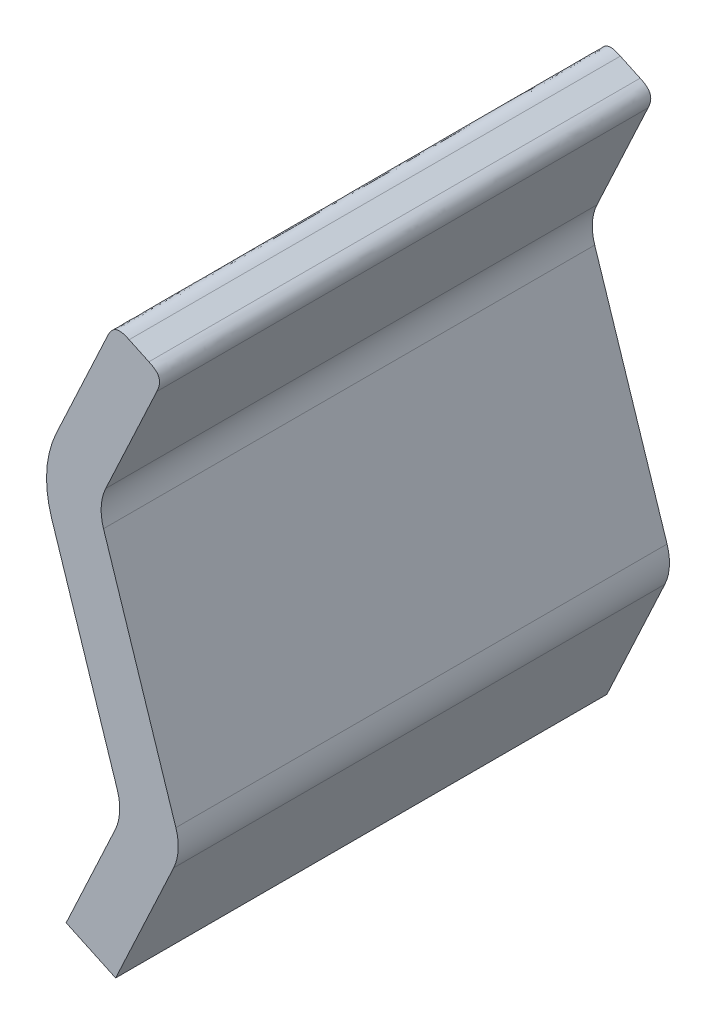
ISO-10303-21;
HEADER;
FILE_DESCRIPTION(('STEP AP214'),'2;1');
FILE_NAME('part.step','',(''),(''),'','','');
FILE_SCHEMA(('AUTOMOTIVE_DESIGN { 1 0 10303 214 1 1 1 1 }'));
ENDSEC;
DATA;
#1=APPLICATION_CONTEXT('core data for automotive mechanical design processes');
#2=APPLICATION_PROTOCOL_DEFINITION('international standard','automotive_design',2000,#1);
#3=PRODUCT_CONTEXT('',#1,'mechanical');
#4=PRODUCT('Part','Part','',(#3));
#5=PRODUCT_RELATED_PRODUCT_CATEGORY('part','',(#4));
#6=PRODUCT_DEFINITION_FORMATION('','',#4);
#7=PRODUCT_DEFINITION_CONTEXT('part definition',#1,'design');
#8=PRODUCT_DEFINITION('design','',#6,#7);
#9=PRODUCT_DEFINITION_SHAPE('','',#8);
#10=(LENGTH_UNIT() NAMED_UNIT(*) SI_UNIT(.MILLI.,.METRE.));
#11=(NAMED_UNIT(*) PLANE_ANGLE_UNIT() SI_UNIT($,.RADIAN.));
#12=(NAMED_UNIT(*) SI_UNIT($,.STERADIAN.) SOLID_ANGLE_UNIT());
#13=UNCERTAINTY_MEASURE_WITH_UNIT(LENGTH_MEASURE(1.E-05),#10,'distance_accuracy_value','');
#14=(GEOMETRIC_REPRESENTATION_CONTEXT(3) GLOBAL_UNCERTAINTY_ASSIGNED_CONTEXT((#13)) GLOBAL_UNIT_ASSIGNED_CONTEXT((#10,
#11,#12)) REPRESENTATION_CONTEXT('',''));
#15=CARTESIAN_POINT('',(0.,0.,0.));
#16=DIRECTION('',(0.,0.,1.));
#17=DIRECTION('',(1.,0.,0.));
#18=AXIS2_PLACEMENT_3D('',#15,#16,#17);
#19=CARTESIAN_POINT('',(-14.1978400032217,-113.814061524335,450.));
#20=DIRECTION('',(0.906239988269344,-0.422763626228155,0.));
#21=DIRECTION('',(0.422763626228155,0.906239988269344,0.));
#22=AXIS2_PLACEMENT_3D('',#19,#20,#21);
#23=PLANE('',#22);
#24=DIRECTION('',(-0.422763626228155,-0.906239988269344,0.));
#25=VECTOR('',#24,1.);
#26=CARTESIAN_POINT('',(-14.1978400032217,-113.814061524335,450.));
#27=LINE('',#26,#25);
#28=CARTESIAN_POINT('',(-22.5243910572331,-131.662932764358,450.));
#29=VERTEX_POINT('',#28);
#30=CARTESIAN_POINT('',(-67.3493273096764,-227.750077408314,450.));
#31=VERTEX_POINT('',#30);
#32=EDGE_CURVE('E150',#29,#31,#27,.T.);
#33=ORIENTED_EDGE('',*,*,#32,.F.);
#34=DIRECTION('',(0.,0.,-1.));
#35=VECTOR('',#34,1.);
#36=CARTESIAN_POINT('',(-22.5243910572331,-131.662932764358,0.));
#37=LINE('',#36,#35);
#38=CARTESIAN_POINT('',(-22.5243910572331,-131.662932764358,0.));
#39=VERTEX_POINT('',#38);
#40=EDGE_CURVE('E172',#29,#39,#37,.T.);
#41=ORIENTED_EDGE('',*,*,#40,.T.);
#42=DIRECTION('',(-0.422763626228155,-0.906239988269344,0.));
#43=VECTOR('',#42,1.);
#44=CARTESIAN_POINT('',(-14.1978400032217,-113.814061524335,0.));
#45=LINE('',#44,#43);
#46=CARTESIAN_POINT('',(-67.3493273096764,-227.750077408314,0.));
#47=VERTEX_POINT('',#46);
#48=EDGE_CURVE('E168',#39,#47,#45,.T.);
#49=ORIENTED_EDGE('',*,*,#48,.T.);
#50=DIRECTION('',(0.,0.,-1.));
#51=VECTOR('',#50,1.);
#52=CARTESIAN_POINT('',(-67.3493273096764,-227.750077408314,450.));
#53=LINE('',#52,#51);
#54=EDGE_CURVE('E166',#31,#47,#53,.T.);
#55=ORIENTED_EDGE('',*,*,#54,.F.);
#56=EDGE_LOOP('',(#33,#41,#49,#55));
#57=FACE_BOUND('',#56,.T.);
#58=ADVANCED_FACE('F40',(#57),#23,.F.);
#59=CARTESIAN_POINT('',(-22.0373278962092,-248.888258719722,450.));
#60=DIRECTION('',(-0.422763626228154,-0.906239988269344,0.));
#61=DIRECTION('',(0.906239988269344,-0.422763626228154,0.));
#62=AXIS2_PLACEMENT_3D('',#59,#60,#61);
#63=PLANE('',#62);
#64=DIRECTION('',(-0.906239988269344,0.422763626228154,0.));
#65=VECTOR('',#64,1.);
#66=CARTESIAN_POINT('',(-22.0373278962092,-248.888258719722,0.));
#67=LINE('',#66,#65);
#68=CARTESIAN_POINT('',(-22.0373278962092,-248.888258719722,0.));
#69=VERTEX_POINT('',#68);
#70=EDGE_CURVE('E413',#69,#47,#67,.T.);
#71=ORIENTED_EDGE('',*,*,#70,.F.);
#72=DIRECTION('',(0.,0.,-1.));
#73=VECTOR('',#72,1.);
#74=CARTESIAN_POINT('',(-22.0373278962092,-248.888258719722,450.));
#75=LINE('',#74,#73);
#76=CARTESIAN_POINT('',(-22.0373278962092,-248.888258719722,450.));
#77=VERTEX_POINT('',#76);
#78=EDGE_CURVE('E173',#77,#69,#75,.T.);
#79=ORIENTED_EDGE('',*,*,#78,.F.);
#80=DIRECTION('',(-0.906239988269344,0.422763626228154,0.));
#81=VECTOR('',#80,1.);
#82=CARTESIAN_POINT('',(-22.0373278962092,-248.888258719722,450.));
#83=LINE('',#82,#81);
#84=EDGE_CURVE('E155',#77,#31,#83,.T.);
#85=ORIENTED_EDGE('',*,*,#84,.T.);
#86=ORIENTED_EDGE('',*,*,#54,.T.);
#87=EDGE_LOOP('',(#71,#79,#85,#86));
#88=FACE_BOUND('',#87,.T.);
#89=ADVANCED_FACE('F175',(#88),#63,.T.);
#90=CARTESIAN_POINT('',(31.1141594102456,-134.952242835743,450.));
#91=DIRECTION('',(0.906239988269344,-0.422763626228155,0.));
#92=DIRECTION('',(0.422763626228155,0.906239988269344,0.));
#93=AXIS2_PLACEMENT_3D('',#90,#91,#92);
#94=PLANE('',#93);
#95=DIRECTION('',(-0.422763626228155,-0.906239988269344,0.));
#96=VECTOR('',#95,1.);
#97=CARTESIAN_POINT('',(31.1141594102456,-134.952242835743,0.));
#98=LINE('',#97,#96);
#99=CARTESIAN_POINT('',(31.1141594102456,-134.952242835743,0.));
#100=VERTEX_POINT('',#99);
#101=EDGE_CURVE('E415',#100,#69,#98,.T.);
#102=ORIENTED_EDGE('',*,*,#101,.F.);
#103=DIRECTION('',(0.,0.,-1.));
#104=VECTOR('',#103,1.);
#105=CARTESIAN_POINT('',(31.1141594102456,-134.952242835743,450.));
#106=LINE('',#105,#104);
#107=CARTESIAN_POINT('',(31.1141594102456,-134.952242835743,450.));
#108=VERTEX_POINT('',#107);
#109=EDGE_CURVE('E436',#108,#100,#106,.T.);
#110=ORIENTED_EDGE('',*,*,#109,.F.);
#111=DIRECTION('',(-0.422763626228155,-0.906239988269344,0.));
#112=VECTOR('',#111,1.);
#113=CARTESIAN_POINT('',(31.1141594102456,-134.952242835743,450.));
#114=LINE('',#113,#112);
#115=EDGE_CURVE('E176',#108,#77,#114,.T.);
#116=ORIENTED_EDGE('',*,*,#115,.T.);
#117=ORIENTED_EDGE('',*,*,#78,.T.);
#118=EDGE_LOOP('',(#102,#110,#116,#117));
#119=FACE_BOUND('',#118,.T.);
#120=ADVANCED_FACE('F231',(#119),#94,.T.);
#121=CARTESIAN_POINT('',(-9.66664006187486,-115.927879655475,450.));
#122=DIRECTION('',(0.,0.,-1.));
#123=DIRECTION('',(-1.,0.,0.));
#124=AXIS2_PLACEMENT_3D('',#121,#122,#123);
#125=CYLINDRICAL_SURFACE('',#124,45.);
#126=CARTESIAN_POINT('',(-9.66664006187486,-115.927879655475,0.));
#127=DIRECTION('',(0.,0.,-1.));
#128=DIRECTION('',(-1.,0.,0.));
#129=AXIS2_PLACEMENT_3D('',#126,#127,#128);
#130=CIRCLE('',#129,45.);
#131=CARTESIAN_POINT('',(33.1331330772249,-102.028979726287,0.));
#132=VERTEX_POINT('',#131);
#133=EDGE_CURVE('E418',#132,#100,#130,.T.);
#134=ORIENTED_EDGE('',*,*,#133,.F.);
#135=DIRECTION('',(0.,0.,-1.));
#136=VECTOR('',#135,1.);
#137=CARTESIAN_POINT('',(33.1331330772249,-102.028979726287,450.));
#138=LINE('',#137,#136);
#139=CARTESIAN_POINT('',(33.1331330772249,-102.028979726287,450.));
#140=VERTEX_POINT('',#139);
#141=EDGE_CURVE('E432',#140,#132,#138,.T.);
#142=ORIENTED_EDGE('',*,*,#141,.F.);
#143=CARTESIAN_POINT('',(-9.66664006187486,-115.927879655475,450.));
#144=DIRECTION('',(0.,0.,-1.));
#145=DIRECTION('',(-1.,0.,0.));
#146=AXIS2_PLACEMENT_3D('',#143,#144,#145);
#147=CIRCLE('',#146,45.);
#148=EDGE_CURVE('E178',#140,#108,#147,.T.);
#149=ORIENTED_EDGE('',*,*,#148,.T.);
#150=ORIENTED_EDGE('',*,*,#109,.T.);
#151=EDGE_LOOP('',(#134,#142,#149,#150));
#152=FACE_BOUND('',#151,.T.);
#153=ADVANCED_FACE('F227',(#152),#125,.T.);
#154=CARTESIAN_POINT('',(-33.1331330772249,102.028979726287,450.));
#155=DIRECTION('',(0.951106069757775,0.308864442870848,0.));
#156=DIRECTION('',(-0.308864442870848,0.951106069757775,0.));
#157=AXIS2_PLACEMENT_3D('',#154,#155,#156);
#158=PLANE('',#157);
#159=DIRECTION('',(0.308864442870848,-0.951106069757775,0.));
#160=VECTOR('',#159,1.);
#161=CARTESIAN_POINT('',(-33.1331330772249,102.028979726287,0.));
#162=LINE('',#161,#160);
#163=CARTESIAN_POINT('',(-33.1331330772249,102.028979726287,0.));
#164=VERTEX_POINT('',#163);
#165=EDGE_CURVE('E421',#164,#132,#162,.T.);
#166=ORIENTED_EDGE('',*,*,#165,.F.);
#167=DIRECTION('',(0.,0.,-1.));
#168=VECTOR('',#167,1.);
#169=CARTESIAN_POINT('',(-33.1331330772249,102.028979726287,450.));
#170=LINE('',#169,#168);
#171=CARTESIAN_POINT('',(-33.1331330772249,102.028979726287,450.));
#172=VERTEX_POINT('',#171);
#173=EDGE_CURVE('E430',#172,#164,#170,.T.);
#174=ORIENTED_EDGE('',*,*,#173,.F.);
#175=DIRECTION('',(0.308864442870848,-0.951106069757775,0.));
#176=VECTOR('',#175,1.);
#177=CARTESIAN_POINT('',(-33.1331330772249,102.028979726287,450.));
#178=LINE('',#177,#176);
#179=EDGE_CURVE('E183',#172,#140,#178,.T.);
#180=ORIENTED_EDGE('',*,*,#179,.T.);
#181=ORIENTED_EDGE('',*,*,#141,.T.);
#182=EDGE_LOOP('',(#166,#174,#180,#181));
#183=FACE_BOUND('',#182,.T.);
#184=ADVANCED_FACE('F223',(#183),#158,.T.);
#185=CARTESIAN_POINT('',(9.6666400618749,115.927879655475,450.));
#186=DIRECTION('',(0.,0.,-1.));
#187=DIRECTION('',(-1.,0.,0.));
#188=AXIS2_PLACEMENT_3D('',#185,#186,#187);
#189=CYLINDRICAL_SURFACE('',#188,45.);
#190=CARTESIAN_POINT('',(9.6666400618749,115.927879655475,0.));
#191=DIRECTION('',(0.,0.,1.));
#192=DIRECTION('',(1.,0.,0.));
#193=AXIS2_PLACEMENT_3D('',#190,#191,#192);
#194=CIRCLE('',#193,45.);
#195=CARTESIAN_POINT('',(-31.1141594102455,134.952242835743,0.));
#196=VERTEX_POINT('',#195);
#197=EDGE_CURVE('E354',#196,#164,#194,.T.);
#198=ORIENTED_EDGE('',*,*,#197,.F.);
#199=DIRECTION('',(0.,0.,-1.));
#200=VECTOR('',#199,1.);
#201=CARTESIAN_POINT('',(-31.1141594102455,134.952242835743,450.));
#202=LINE('',#201,#200);
#203=CARTESIAN_POINT('',(-31.1141594102455,134.952242835743,450.));
#204=VERTEX_POINT('',#203);
#205=EDGE_CURVE('E428',#204,#196,#202,.T.);
#206=ORIENTED_EDGE('',*,*,#205,.F.);
#207=CARTESIAN_POINT('',(9.6666400618749,115.927879655475,450.));
#208=DIRECTION('',(0.,0.,1.));
#209=DIRECTION('',(1.,0.,0.));
#210=AXIS2_PLACEMENT_3D('',#207,#208,#209);
#211=CIRCLE('',#210,45.);
#212=EDGE_CURVE('E186',#204,#172,#211,.T.);
#213=ORIENTED_EDGE('',*,*,#212,.T.);
#214=ORIENTED_EDGE('',*,*,#173,.T.);
#215=EDGE_LOOP('',(#198,#206,#213,#214));
#216=FACE_BOUND('',#215,.T.);
#217=ADVANCED_FACE('F218',(#216),#189,.F.);
#218=CARTESIAN_POINT('',(22.0373278962092,248.888258719722,450.));
#219=DIRECTION('',(0.906239988269344,-0.422763626228155,0.));
#220=DIRECTION('',(0.422763626228155,0.906239988269344,0.));
#221=AXIS2_PLACEMENT_3D('',#218,#219,#220);
#222=PLANE('',#221);
#223=DIRECTION('',(-0.422763626228155,-0.906239988269344,0.));
#224=VECTOR('',#223,1.);
#225=CARTESIAN_POINT('',(22.0373278962092,248.888258719722,0.));
#226=LINE('',#225,#224);
#227=CARTESIAN_POINT('',(15.6958735027869,235.294658895682,0.));
#228=VERTEX_POINT('',#227);
#229=EDGE_CURVE('E337',#228,#196,#226,.T.);
#230=ORIENTED_EDGE('',*,*,#229,.F.);
#231=CARTESIAN_POINT('',(15.6958735027869,235.294658895682,472.5));
#232=CARTESIAN_POINT('',(15.6958735027869,235.294658895682,307.499999990841));
#233=CARTESIAN_POINT('',(15.6958735027869,235.294658895682,142.5));
#234=CARTESIAN_POINT('',(15.6958735027869,235.294658895682,-22.5000000000001));
#235=B_SPLINE_CURVE_WITH_KNOTS('',3,(#231,#232,#233,#234),.UNSPECIFIED.,.F.,.F.,(4,4),(-0.0225,
0.4725),.UNSPECIFIED.);
#236=CARTESIAN_POINT('',(15.6958735027869,235.294658895682,450.));
#237=VERTEX_POINT('',#236);
#238=EDGE_CURVE('E70',#228,#237,#235,.F.);
#239=ORIENTED_EDGE('',*,*,#238,.T.);
#240=DIRECTION('',(-0.422763626228155,-0.906239988269344,0.));
#241=VECTOR('',#240,1.);
#242=CARTESIAN_POINT('',(22.0373278962092,248.888258719722,450.));
#243=LINE('',#242,#241);
#244=EDGE_CURVE('E189',#237,#204,#243,.T.);
#245=ORIENTED_EDGE('',*,*,#244,.T.);
#246=ORIENTED_EDGE('',*,*,#205,.T.);
#247=EDGE_LOOP('',(#230,#239,#245,#246));
#248=FACE_BOUND('',#247,.T.);
#249=ADVANCED_FACE('F207',(#248),#222,.T.);
#250=CARTESIAN_POINT('',(-23.274671517258,270.02644003113,450.));
#251=DIRECTION('',(0.422763626228155,0.906239988269344,0.));
#252=DIRECTION('',(-0.906239988269344,0.422763626228155,0.));
#253=AXIS2_PLACEMENT_3D('',#250,#251,#252);
#254=PLANE('',#253);
#255=DIRECTION('',(0.906239988269344,-0.422763626228155,0.));
#256=VECTOR('',#255,1.);
#257=CARTESIAN_POINT('',(-23.274671517258,270.02644003113,450.));
#258=LINE('',#257,#256);
#259=CARTESIAN_POINT('',(-9.68107169321786,263.684985637707,450.));
#260=VERTEX_POINT('',#259);
#261=CARTESIAN_POINT('',(8.44372807216904,255.229713113144,450.));
#262=VERTEX_POINT('',#261);
#263=EDGE_CURVE('E196',#260,#262,#258,.T.);
#264=ORIENTED_EDGE('',*,*,#263,.T.);
#265=CARTESIAN_POINT('',(8.44372807216903,255.229713113144,-22.5000000000001));
#266=CARTESIAN_POINT('',(8.44372807216903,255.229713113144,142.5));
#267=CARTESIAN_POINT('',(8.44372807216903,255.229713113144,307.499999990841));
#268=CARTESIAN_POINT('',(8.44372807216903,255.229713113144,472.5));
#269=B_SPLINE_CURVE_WITH_KNOTS('',3,(#265,#266,#267,#268),.UNSPECIFIED.,.F.,.F.,(4,4),(-0.0225,
0.4725),.UNSPECIFIED.);
#270=CARTESIAN_POINT('',(8.44372807216904,255.229713113144,0.));
#271=VERTEX_POINT('',#270);
#272=EDGE_CURVE('E324',#262,#271,#269,.F.);
#273=ORIENTED_EDGE('',*,*,#272,.T.);
#274=DIRECTION('',(0.906239988269344,-0.422763626228155,0.));
#275=VECTOR('',#274,1.);
#276=CARTESIAN_POINT('',(-23.274671517258,270.02644003113,0.));
#277=LINE('',#276,#275);
#278=CARTESIAN_POINT('',(-9.68107169321778,263.684985637707,0.));
#279=VERTEX_POINT('',#278);
#280=EDGE_CURVE('E332',#279,#271,#277,.T.);
#281=ORIENTED_EDGE('',*,*,#280,.F.);
#282=CARTESIAN_POINT('',(-9.68107169321787,263.684985637707,472.5));
#283=CARTESIAN_POINT('',(-9.68107169321787,263.684985637707,307.499999990841));
#284=CARTESIAN_POINT('',(-9.68107169321787,263.684985637707,142.5));
#285=CARTESIAN_POINT('',(-9.68107169321787,263.684985637707,-22.5));
#286=B_SPLINE_CURVE_WITH_KNOTS('',3,(#282,#283,#284,#285),.UNSPECIFIED.,.F.,.F.,(4,4),(-0.4725,
0.0225),.UNSPECIFIED.);
#287=EDGE_CURVE('E319',#279,#260,#286,.F.);
#288=ORIENTED_EDGE('',*,*,#287,.T.);
#289=EDGE_LOOP('',(#264,#273,#281,#288));
#290=FACE_BOUND('',#289,.T.);
#291=ADVANCED_FACE('F217',(#290),#254,.T.);
#292=CARTESIAN_POINT('',(-23.274671517258,270.02644003113,450.));
#293=DIRECTION('',(0.906239988269344,-0.422763626228155,0.));
#294=DIRECTION('',(0.422763626228155,0.906239988269344,0.));
#295=AXIS2_PLACEMENT_3D('',#292,#293,#294);
#296=PLANE('',#295);
#297=DIRECTION('',(-0.422763626228155,-0.906239988269344,0.));
#298=VECTOR('',#297,1.);
#299=CARTESIAN_POINT('',(-23.274671517258,270.02644003113,450.));
#300=LINE('',#299,#298);
#301=CARTESIAN_POINT('',(-29.6161259106804,256.432840207089,450.));
#302=VERTEX_POINT('',#301);
#303=CARTESIAN_POINT('',(-76.4261588237126,156.090424147151,450.));
#304=VERTEX_POINT('',#303);
#305=EDGE_CURVE('E206',#302,#304,#300,.T.);
#306=ORIENTED_EDGE('',*,*,#305,.F.);
#307=CARTESIAN_POINT('',(-29.6161259106804,256.432840207089,-22.5));
#308=CARTESIAN_POINT('',(-29.6161259106804,256.432840207089,142.5));
#309=CARTESIAN_POINT('',(-29.6161259106804,256.432840207089,307.499999990841));
#310=CARTESIAN_POINT('',(-29.6161259106804,256.432840207089,472.5));
#311=B_SPLINE_CURVE_WITH_KNOTS('',3,(#307,#308,#309,#310),.UNSPECIFIED.,.F.,.F.,(4,4),(-0.4725,
0.0225),.UNSPECIFIED.);
#312=CARTESIAN_POINT('',(-29.6161259106804,256.432840207089,0.));
#313=VERTEX_POINT('',#312);
#314=EDGE_CURVE('E11',#302,#313,#311,.F.);
#315=ORIENTED_EDGE('',*,*,#314,.T.);
#316=DIRECTION('',(-0.422763626228155,-0.906239988269344,0.));
#317=VECTOR('',#316,1.);
#318=CARTESIAN_POINT('',(-23.274671517258,270.02644003113,0.));
#319=LINE('',#318,#317);
#320=CARTESIAN_POINT('',(-76.4261588237126,156.090424147151,0.));
#321=VERTEX_POINT('',#320);
#322=EDGE_CURVE('E336',#313,#321,#319,.T.);
#323=ORIENTED_EDGE('',*,*,#322,.T.);
#324=DIRECTION('',(0.,0.,-1.));
#325=VECTOR('',#324,1.);
#326=CARTESIAN_POINT('',(-76.4261588237126,156.090424147151,450.));
#327=LINE('',#326,#325);
#328=EDGE_CURVE('E450',#304,#321,#327,.T.);
#329=ORIENTED_EDGE('',*,*,#328,.F.);
#330=EDGE_LOOP('',(#306,#315,#323,#329));
#331=FACE_BOUND('',#330,.T.);
#332=ADVANCED_FACE('F377',(#331),#296,.F.);
#333=CARTESIAN_POINT('',(9.6666400618749,115.927879655475,450.));
#334=DIRECTION('',(0.,0.,-1.));
#335=DIRECTION('',(-1.,0.,0.));
#336=AXIS2_PLACEMENT_3D('',#333,#334,#335);
#337=CYLINDRICAL_SURFACE('',#336,95.);
#338=CARTESIAN_POINT('',(9.6666400618749,115.927879655475,0.));
#339=DIRECTION('',(0.,0.,1.));
#340=DIRECTION('',(1.,0.,0.));
#341=AXIS2_PLACEMENT_3D('',#338,#339,#340);
#342=CIRCLE('',#341,95.);
#343=CARTESIAN_POINT('',(-80.6884365651136,86.5857575827448,0.));
#344=VERTEX_POINT('',#343);
#345=EDGE_CURVE('E345',#321,#344,#342,.T.);
#346=ORIENTED_EDGE('',*,*,#345,.T.);
#347=DIRECTION('',(0.,0.,-1.));
#348=VECTOR('',#347,1.);
#349=CARTESIAN_POINT('',(-80.6884365651136,86.5857575827448,450.));
#350=LINE('',#349,#348);
#351=CARTESIAN_POINT('',(-80.6884365651136,86.5857575827448,450.));
#352=VERTEX_POINT('',#351);
#353=EDGE_CURVE('E408',#352,#344,#350,.T.);
#354=ORIENTED_EDGE('',*,*,#353,.F.);
#355=CARTESIAN_POINT('',(9.6666400618749,115.927879655475,450.));
#356=DIRECTION('',(0.,0.,1.));
#357=DIRECTION('',(1.,0.,0.));
#358=AXIS2_PLACEMENT_3D('',#355,#356,#357);
#359=CIRCLE('',#358,95.);
#360=EDGE_CURVE('E402',#304,#352,#359,.T.);
#361=ORIENTED_EDGE('',*,*,#360,.F.);
#362=ORIENTED_EDGE('',*,*,#328,.T.);
#363=EDGE_LOOP('',(#346,#354,#361,#362));
#364=FACE_BOUND('',#363,.T.);
#365=ADVANCED_FACE('F374',(#364),#337,.T.);
#366=CARTESIAN_POINT('',(-80.6884365651136,86.5857575827448,450.));
#367=DIRECTION('',(0.951106069757775,0.308864442870848,0.));
#368=DIRECTION('',(-0.308864442870848,0.951106069757775,0.));
#369=AXIS2_PLACEMENT_3D('',#366,#367,#368);
#370=PLANE('',#369);
#371=DIRECTION('',(0.308864442870848,-0.951106069757775,0.));
#372=VECTOR('',#371,1.);
#373=CARTESIAN_POINT('',(-80.6884365651136,86.5857575827448,0.));
#374=LINE('',#373,#372);
#375=CARTESIAN_POINT('',(-20.5054173902537,-98.7396696549025,0.));
#376=VERTEX_POINT('',#375);
#377=EDGE_CURVE('E163',#344,#376,#374,.T.);
#378=ORIENTED_EDGE('',*,*,#377,.T.);
#379=DIRECTION('',(0.,0.,-1.));
#380=VECTOR('',#379,1.);
#381=CARTESIAN_POINT('',(-20.5054173902537,-98.7396696549025,450.));
#382=LINE('',#381,#380);
#383=CARTESIAN_POINT('',(-20.5054173902537,-98.7396696549025,450.));
#384=VERTEX_POINT('',#383);
#385=EDGE_CURVE('E328',#376,#384,#382,.F.);
#386=ORIENTED_EDGE('',*,*,#385,.T.);
#387=DIRECTION('',(0.308864442870848,-0.951106069757775,0.));
#388=VECTOR('',#387,1.);
#389=CARTESIAN_POINT('',(-80.6884365651136,86.5857575827448,450.));
#390=LINE('',#389,#388);
#391=EDGE_CURVE('E404',#352,#384,#390,.T.);
#392=ORIENTED_EDGE('',*,*,#391,.F.);
#393=ORIENTED_EDGE('',*,*,#353,.T.);
#394=EDGE_LOOP('',(#378,#386,#392,#393));
#395=FACE_BOUND('',#394,.T.);
#396=ADVANCED_FACE('F370',(#395),#370,.F.);
#397=CARTESIAN_POINT('',(-9.66664006187486,-115.927879655475,450.));
#398=DIRECTION('',(0.,0.,-1.));
#399=DIRECTION('',(-1.,0.,0.));
#400=AXIS2_PLACEMENT_3D('',#397,#398,#399);
#401=PLANE('',#400);
#402=ORIENTED_EDGE('',*,*,#244,.F.);
#403=CARTESIAN_POINT('',(8.44372807216903,255.229713113144,450.00000000044));
#404=CARTESIAN_POINT('',(10.7301450759048,254.163092840279,450.00000000044));
#405=CARTESIAN_POINT('',(13.0165620796405,253.096472567414,450.00000000044));
#406=CARTESIAN_POINT('',(17.6012236484666,249.771076440101,449.999999999302));
#407=CARTESIAN_POINT('',(19.2054076380921,245.361416552014,449.999999999302));
#408=CARTESIAN_POINT('',(17.8291140485169,239.867492903153,450.00000000044));
#409=CARTESIAN_POINT('',(16.7624937756519,237.581075899417,450.00000000044));
#410=CARTESIAN_POINT('',(15.6958735027869,235.294658895682,450.00000000044));
#411=B_SPLINE_CURVE_WITH_KNOTS('',5,(#403,#404,#405,#406,#407,#408,#409,#410),.UNSPECIFIED.,.F.,
.F.,(6,2,6),(0.,0.5,1.),.UNSPECIFIED.);
#412=EDGE_CURVE('E54',#237,#262,#411,.F.);
#413=ORIENTED_EDGE('',*,*,#412,.T.);
#414=ORIENTED_EDGE('',*,*,#263,.F.);
#415=CARTESIAN_POINT('',(-29.6161259106804,256.432840207089,450.));
#416=CARTESIAN_POINT('',(-28.5495056378153,258.719257210825,450.));
#417=CARTESIAN_POINT('',(-27.4828853649503,261.005674214561,450.));
#418=CARTESIAN_POINT('',(-24.1574892376373,265.590335783387,450.));
#419=CARTESIAN_POINT('',(-19.7478293495503,267.194519773012,450.));
#420=CARTESIAN_POINT('',(-14.2539057006894,265.818226183437,450.));
#421=CARTESIAN_POINT('',(-11.9674886969536,264.751605910572,450.));
#422=CARTESIAN_POINT('',(-9.68107169321787,263.684985637707,450.));
#423=B_SPLINE_CURVE_WITH_KNOTS('',5,(#415,#416,#417,#418,#419,#420,#421,#422),.UNSPECIFIED.,.F.,
.F.,(6,2,6),(0.,0.5,1.),.UNSPECIFIED.);
#424=EDGE_CURVE('E61',#260,#302,#423,.F.);
#425=ORIENTED_EDGE('',*,*,#424,.T.);
#426=ORIENTED_EDGE('',*,*,#305,.T.);
#427=ORIENTED_EDGE('',*,*,#360,.T.);
#428=ORIENTED_EDGE('',*,*,#391,.T.);
#429=CARTESIAN_POINT('',(-63.3051905293536,-112.638569584091,450.));
#430=DIRECTION('',(0.,0.,-1.));
#431=DIRECTION('',(-1.,0.,0.));
#432=AXIS2_PLACEMENT_3D('',#429,#430,#431);
#433=CIRCLE('',#432,45.);
#434=EDGE_CURVE('E159',#384,#29,#433,.T.);
#435=ORIENTED_EDGE('',*,*,#434,.T.);
#436=ORIENTED_EDGE('',*,*,#32,.T.);
#437=ORIENTED_EDGE('',*,*,#84,.F.);
#438=ORIENTED_EDGE('',*,*,#115,.F.);
#439=ORIENTED_EDGE('',*,*,#148,.F.);
#440=ORIENTED_EDGE('',*,*,#179,.F.);
#441=ORIENTED_EDGE('',*,*,#212,.F.);
#442=EDGE_LOOP('',(#402,#413,#414,#425,#426,#427,#428,#435,#436,#437,#438,#439,#440,#441));
#443=FACE_BOUND('',#442,.T.);
#444=ADVANCED_FACE('F152',(#443),#401,.F.);
#445=CARTESIAN_POINT('',(-9.66664006187486,-115.927879655475,0.));
#446=DIRECTION('',(0.,0.,-1.));
#447=DIRECTION('',(-1.,0.,0.));
#448=AXIS2_PLACEMENT_3D('',#445,#446,#447);
#449=PLANE('',#448);
#450=ORIENTED_EDGE('',*,*,#280,.T.);
#451=CARTESIAN_POINT('',(15.6958735027869,235.294658895682,2.08973463533546E-11));
#452=CARTESIAN_POINT('',(16.7624937756519,237.581075899417,2.08973463533546E-11));
#453=CARTESIAN_POINT('',(17.8291140485169,239.867492903153,2.08973463533546E-11));
#454=CARTESIAN_POINT('',(19.2054076380921,245.361416552014,-3.32945476744229E-11));
#455=CARTESIAN_POINT('',(17.6012236484666,249.771076440101,-3.32945476744229E-11));
#456=CARTESIAN_POINT('',(13.0165620796405,253.096472567414,2.08973463533546E-11));
#457=CARTESIAN_POINT('',(10.7301450759048,254.163092840279,2.08973463533546E-11));
#458=CARTESIAN_POINT('',(8.44372807216903,255.229713113144,2.08973463533546E-11));
#459=B_SPLINE_CURVE_WITH_KNOTS('',5,(#451,#452,#453,#454,#455,#456,#457,#458),.UNSPECIFIED.,.F.,
.F.,(6,2,6),(0.,0.5,1.),.UNSPECIFIED.);
#460=EDGE_CURVE('E393',#271,#228,#459,.F.);
#461=ORIENTED_EDGE('',*,*,#460,.T.);
#462=ORIENTED_EDGE('',*,*,#229,.T.);
#463=ORIENTED_EDGE('',*,*,#197,.T.);
#464=ORIENTED_EDGE('',*,*,#165,.T.);
#465=ORIENTED_EDGE('',*,*,#133,.T.);
#466=ORIENTED_EDGE('',*,*,#101,.T.);
#467=ORIENTED_EDGE('',*,*,#70,.T.);
#468=ORIENTED_EDGE('',*,*,#48,.F.);
#469=CARTESIAN_POINT('',(-63.3051905293536,-112.638569584091,0.));
#470=DIRECTION('',(0.,0.,-1.));
#471=DIRECTION('',(-1.,0.,0.));
#472=AXIS2_PLACEMENT_3D('',#469,#470,#471);
#473=CIRCLE('',#472,45.);
#474=EDGE_CURVE('E326',#39,#376,#473,.F.);
#475=ORIENTED_EDGE('',*,*,#474,.T.);
#476=ORIENTED_EDGE('',*,*,#377,.F.);
#477=ORIENTED_EDGE('',*,*,#345,.F.);
#478=ORIENTED_EDGE('',*,*,#322,.F.);
#479=CARTESIAN_POINT('',(-9.68107169321787,263.684985637707,0.));
#480=CARTESIAN_POINT('',(-11.9674886969536,264.751605910572,0.));
#481=CARTESIAN_POINT('',(-14.2539057006894,265.818226183437,0.));
#482=CARTESIAN_POINT('',(-19.7478293495503,267.194519773012,0.));
#483=CARTESIAN_POINT('',(-24.1574892376373,265.590335783387,0.));
#484=CARTESIAN_POINT('',(-27.4828853649503,261.005674214561,0.));
#485=CARTESIAN_POINT('',(-28.5495056378153,258.719257210825,0.));
#486=CARTESIAN_POINT('',(-29.6161259106803,256.432840207089,0.));
#487=B_SPLINE_CURVE_WITH_KNOTS('',5,(#479,#480,#481,#482,#483,#484,#485,#486),.UNSPECIFIED.,.F.,
.F.,(6,2,6),(0.,0.5,1.),.UNSPECIFIED.);
#488=EDGE_CURVE('E293',#313,#279,#487,.F.);
#489=ORIENTED_EDGE('',*,*,#488,.T.);
#490=EDGE_LOOP('',(#450,#461,#462,#463,#464,#465,#466,#467,#468,#475,#476,#477,#478,#489));
#491=FACE_BOUND('',#490,.T.);
#492=ADVANCED_FACE('F243',(#491),#449,.T.);
#493=CARTESIAN_POINT('',(-63.3051905293536,-112.638569584091,450.));
#494=DIRECTION('',(0.,0.,1.));
#495=DIRECTION('',(1.,0.,0.));
#496=AXIS2_PLACEMENT_3D('',#493,#494,#495);
#497=CYLINDRICAL_SURFACE('',#496,45.);
#498=ORIENTED_EDGE('',*,*,#434,.F.);
#499=ORIENTED_EDGE('',*,*,#385,.F.);
#500=ORIENTED_EDGE('',*,*,#474,.F.);
#501=ORIENTED_EDGE('',*,*,#40,.F.);
#502=EDGE_LOOP('',(#498,#499,#500,#501));
#503=FACE_BOUND('',#502,.T.);
#504=ADVANCED_FACE('F240',(#503),#497,.F.);
#505=CARTESIAN_POINT('',(8.44372807216903,255.229713113144,472.5));
#506=CARTESIAN_POINT('',(8.44372807216903,255.229713113144,307.499999990841));
#507=CARTESIAN_POINT('',(8.44372807216903,255.229713113144,142.5));
#508=CARTESIAN_POINT('',(8.44372807216903,255.229713113144,-22.5000000000001));
#509=CARTESIAN_POINT('',(10.7301450759048,254.163092840279,472.5));
#510=CARTESIAN_POINT('',(10.7301450759048,254.163092840279,307.499999990841));
#511=CARTESIAN_POINT('',(10.7301450759048,254.163092840279,142.5));
#512=CARTESIAN_POINT('',(10.7301450759048,254.163092840279,-22.5000000000001));
#513=CARTESIAN_POINT('',(13.0165620796405,253.096472567414,472.5));
#514=CARTESIAN_POINT('',(13.0165620796405,253.096472567414,307.499999990841));
#515=CARTESIAN_POINT('',(13.0165620796405,253.096472567414,142.5));
#516=CARTESIAN_POINT('',(13.0165620796405,253.096472567414,-22.5000000000001));
#517=CARTESIAN_POINT('',(17.6012236484666,249.771076440101,472.5));
#518=CARTESIAN_POINT('',(17.6012236484666,249.771076440101,307.499999981681));
#519=CARTESIAN_POINT('',(17.6012236484666,249.771076440101,142.5));
#520=CARTESIAN_POINT('',(17.6012236484666,249.771076440101,-22.5000000000001));
#521=CARTESIAN_POINT('',(19.2054076380921,245.361416552014,472.5));
#522=CARTESIAN_POINT('',(19.2054076380921,245.361416552014,307.499999981681));
#523=CARTESIAN_POINT('',(19.2054076380921,245.361416552014,142.5));
#524=CARTESIAN_POINT('',(19.2054076380921,245.361416552014,-22.5000000000001));
#525=CARTESIAN_POINT('',(17.8291140485169,239.867492903153,472.5));
#526=CARTESIAN_POINT('',(17.8291140485169,239.867492903153,307.499999990841));
#527=CARTESIAN_POINT('',(17.8291140485169,239.867492903153,142.5));
#528=CARTESIAN_POINT('',(17.8291140485169,239.867492903153,-22.5000000000001));
#529=CARTESIAN_POINT('',(16.7624937756519,237.581075899417,472.5));
#530=CARTESIAN_POINT('',(16.7624937756519,237.581075899417,307.499999990841));
#531=CARTESIAN_POINT('',(16.7624937756519,237.581075899417,142.5));
#532=CARTESIAN_POINT('',(16.7624937756519,237.581075899417,-22.5000000000001));
#533=CARTESIAN_POINT('',(15.6958735027869,235.294658895682,472.5));
#534=CARTESIAN_POINT('',(15.6958735027869,235.294658895682,307.499999990841));
#535=CARTESIAN_POINT('',(15.6958735027869,235.294658895682,142.5));
#536=CARTESIAN_POINT('',(15.6958735027869,235.294658895682,-22.5000000000001));
#537=B_SPLINE_SURFACE_WITH_KNOTS('',5,3,((#505,#506,#507,#508),(#509,#510,#511,#512),(#513,#514,
#515,#516),(#517,#518,#519,#520),(#521,#522,#523,#524),(#525,#526,#527,#528),(#529,#530,#531,
#532),(#533,#534,#535,#536)),.UNSPECIFIED.,.F.,.F.,.F.,(6,2,6),(4,4),(0.,0.5,1.),(-0.0225,
0.4725),.UNSPECIFIED.);
#538=ORIENTED_EDGE('',*,*,#412,.F.);
#539=ORIENTED_EDGE('',*,*,#238,.F.);
#540=ORIENTED_EDGE('',*,*,#460,.F.);
#541=ORIENTED_EDGE('',*,*,#272,.F.);
#542=EDGE_LOOP('',(#538,#539,#540,#541));
#543=FACE_BOUND('',#542,.T.);
#544=ADVANCED_FACE('F242',(#543),#537,.T.);
#545=CARTESIAN_POINT('',(-9.68107169321787,263.684985637707,-22.5));
#546=CARTESIAN_POINT('',(-9.68107169321787,263.684985637707,142.5));
#547=CARTESIAN_POINT('',(-9.68107169321787,263.684985637707,307.499999990841));
#548=CARTESIAN_POINT('',(-9.68107169321787,263.684985637707,472.5));
#549=CARTESIAN_POINT('',(-11.9674886969536,264.751605910572,-22.5));
#550=CARTESIAN_POINT('',(-11.9674886969536,264.751605910572,142.5));
#551=CARTESIAN_POINT('',(-11.9674886969536,264.751605910572,307.499999990841));
#552=CARTESIAN_POINT('',(-11.9674886969536,264.751605910572,472.5));
#553=CARTESIAN_POINT('',(-14.2539057006894,265.818226183437,-22.5));
#554=CARTESIAN_POINT('',(-14.2539057006894,265.818226183437,142.5));
#555=CARTESIAN_POINT('',(-14.2539057006894,265.818226183437,307.499999990841));
#556=CARTESIAN_POINT('',(-14.2539057006894,265.818226183437,472.5));
#557=CARTESIAN_POINT('',(-19.7478293495503,267.194519773012,-22.5));
#558=CARTESIAN_POINT('',(-19.7478293495503,267.194519773012,142.5));
#559=CARTESIAN_POINT('',(-19.7478293495503,267.194519773012,307.499999990841));
#560=CARTESIAN_POINT('',(-19.7478293495503,267.194519773012,472.5));
#561=CARTESIAN_POINT('',(-24.1574892376373,265.590335783387,-22.5));
#562=CARTESIAN_POINT('',(-24.1574892376373,265.590335783387,142.5));
#563=CARTESIAN_POINT('',(-24.1574892376373,265.590335783387,307.499999990841));
#564=CARTESIAN_POINT('',(-24.1574892376373,265.590335783387,472.5));
#565=CARTESIAN_POINT('',(-27.4828853649503,261.005674214561,-22.5));
#566=CARTESIAN_POINT('',(-27.4828853649503,261.005674214561,142.5));
#567=CARTESIAN_POINT('',(-27.4828853649503,261.005674214561,307.499999990841));
#568=CARTESIAN_POINT('',(-27.4828853649503,261.005674214561,472.5));
#569=CARTESIAN_POINT('',(-28.5495056378153,258.719257210825,-22.5));
#570=CARTESIAN_POINT('',(-28.5495056378153,258.719257210825,142.5));
#571=CARTESIAN_POINT('',(-28.5495056378153,258.719257210825,307.499999990841));
#572=CARTESIAN_POINT('',(-28.5495056378153,258.719257210825,472.5));
#573=CARTESIAN_POINT('',(-29.6161259106804,256.432840207089,-22.5));
#574=CARTESIAN_POINT('',(-29.6161259106804,256.432840207089,142.5));
#575=CARTESIAN_POINT('',(-29.6161259106804,256.432840207089,307.499999990841));
#576=CARTESIAN_POINT('',(-29.6161259106804,256.432840207089,472.5));
#577=B_SPLINE_SURFACE_WITH_KNOTS('',5,3,((#545,#546,#547,#548),(#549,#550,#551,#552),(#553,#554,
#555,#556),(#557,#558,#559,#560),(#561,#562,#563,#564),(#565,#566,#567,#568),(#569,#570,#571,
#572),(#573,#574,#575,#576)),.UNSPECIFIED.,.F.,.F.,.F.,(6,2,6),(4,4),(0.,0.5,1.),(-0.4725,
0.0225),.UNSPECIFIED.);
#578=ORIENTED_EDGE('',*,*,#424,.F.);
#579=ORIENTED_EDGE('',*,*,#287,.F.);
#580=ORIENTED_EDGE('',*,*,#488,.F.);
#581=ORIENTED_EDGE('',*,*,#314,.F.);
#582=EDGE_LOOP('',(#578,#579,#580,#581));
#583=FACE_BOUND('',#582,.T.);
#584=ADVANCED_FACE('F43',(#583),#577,.T.);
#585=CLOSED_SHELL('',(#58,#89,#120,#153,#184,#217,#249,#291,#332,#365,#396,#444,#492,#504,#544,#584));
#586=MANIFOLD_SOLID_BREP('B2',#585);
#587=ADVANCED_BREP_SHAPE_REPRESENTATION('',(#18,#586),#14);
#588=SHAPE_DEFINITION_REPRESENTATION(#9,#587);
ENDSEC;
END-ISO-10303-21;
